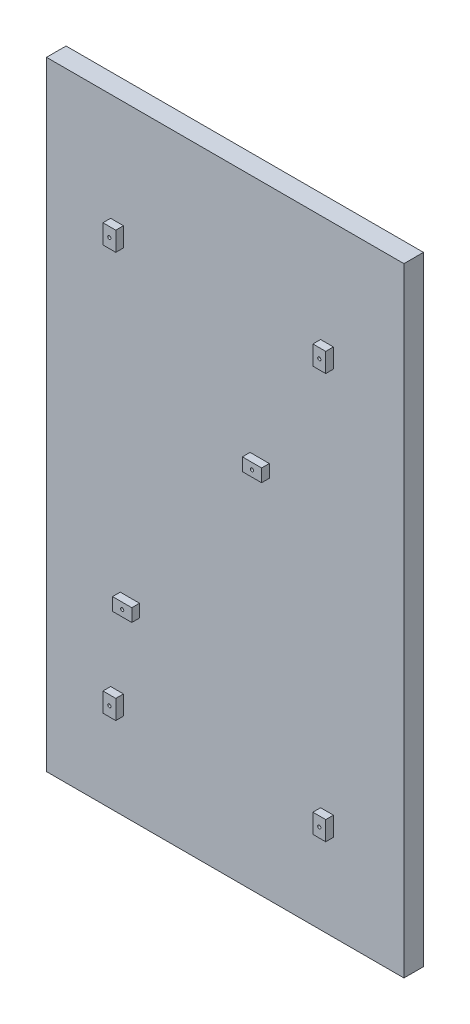
ISO-10303-21;
HEADER;
FILE_DESCRIPTION(('STEP AP214'),'2;1');
FILE_NAME('part.step','',(''),(''),'','','');
FILE_SCHEMA(('AUTOMOTIVE_DESIGN { 1 0 10303 214 1 1 1 1 }'));
ENDSEC;
DATA;
#1=APPLICATION_CONTEXT('core data for automotive mechanical design processes');
#2=APPLICATION_PROTOCOL_DEFINITION('international standard','automotive_design',2000,#1);
#3=PRODUCT_CONTEXT('',#1,'mechanical');
#4=PRODUCT('Part','Part','',(#3));
#5=PRODUCT_RELATED_PRODUCT_CATEGORY('part','',(#4));
#6=PRODUCT_DEFINITION_FORMATION('','',#4);
#7=PRODUCT_DEFINITION_CONTEXT('part definition',#1,'design');
#8=PRODUCT_DEFINITION('design','',#6,#7);
#9=PRODUCT_DEFINITION_SHAPE('','',#8);
#10=(LENGTH_UNIT() NAMED_UNIT(*) SI_UNIT(.MILLI.,.METRE.));
#11=(NAMED_UNIT(*) PLANE_ANGLE_UNIT() SI_UNIT($,.RADIAN.));
#12=(NAMED_UNIT(*) SI_UNIT($,.STERADIAN.) SOLID_ANGLE_UNIT());
#13=UNCERTAINTY_MEASURE_WITH_UNIT(LENGTH_MEASURE(1.E-05),#10,'distance_accuracy_value','');
#14=(GEOMETRIC_REPRESENTATION_CONTEXT(3) GLOBAL_UNCERTAINTY_ASSIGNED_CONTEXT((#13)) GLOBAL_UNIT_ASSIGNED_CONTEXT((#10,
#11,#12)) REPRESENTATION_CONTEXT('',''));
#15=CARTESIAN_POINT('',(0.,0.,0.));
#16=DIRECTION('',(0.,0.,1.));
#17=DIRECTION('',(1.,0.,0.));
#18=AXIS2_PLACEMENT_3D('',#15,#16,#17);
#19=CARTESIAN_POINT('',(111.5,0.,6.1));
#20=DIRECTION('',(0.,1.,0.));
#21=DIRECTION('',(0.,0.,1.));
#22=AXIS2_PLACEMENT_3D('',#19,#20,#21);
#23=PLANE('',#22);
#24=DIRECTION('',(1.,0.,0.));
#25=VECTOR('',#24,1.);
#26=CARTESIAN_POINT('',(111.5,0.,0.));
#27=LINE('',#26,#25);
#28=CARTESIAN_POINT('',(0.,0.,0.));
#29=VERTEX_POINT('',#28);
#30=CARTESIAN_POINT('',(111.5,0.,0.));
#31=VERTEX_POINT('',#30);
#32=EDGE_CURVE('E437',#29,#31,#27,.T.);
#33=ORIENTED_EDGE('',*,*,#32,.T.);
#34=DIRECTION('',(0.,0.,-1.));
#35=VECTOR('',#34,1.);
#36=CARTESIAN_POINT('',(111.5,0.,6.1));
#37=LINE('',#36,#35);
#38=CARTESIAN_POINT('',(111.5,0.,6.1));
#39=VERTEX_POINT('',#38);
#40=EDGE_CURVE('E11',#39,#31,#37,.T.);
#41=ORIENTED_EDGE('',*,*,#40,.F.);
#42=DIRECTION('',(1.,0.,0.));
#43=VECTOR('',#42,1.);
#44=CARTESIAN_POINT('',(111.5,0.,6.1));
#45=LINE('',#44,#43);
#46=CARTESIAN_POINT('',(0.,0.,6.1));
#47=VERTEX_POINT('',#46);
#48=EDGE_CURVE('E438',#47,#39,#45,.T.);
#49=ORIENTED_EDGE('',*,*,#48,.F.);
#50=DIRECTION('',(0.,0.,-1.));
#51=VECTOR('',#50,1.);
#52=CARTESIAN_POINT('',(0.,0.,6.1));
#53=LINE('',#52,#51);
#54=EDGE_CURVE('E448',#47,#29,#53,.T.);
#55=ORIENTED_EDGE('',*,*,#54,.T.);
#56=EDGE_LOOP('',(#33,#41,#49,#55));
#57=FACE_BOUND('',#56,.T.);
#58=ADVANCED_FACE('F32',(#57),#23,.F.);
#59=CARTESIAN_POINT('',(111.5,193.,6.1));
#60=DIRECTION('',(-1.,0.,0.));
#61=DIRECTION('',(0.,0.,1.));
#62=AXIS2_PLACEMENT_3D('',#59,#60,#61);
#63=PLANE('',#62);
#64=DIRECTION('',(0.,1.,0.));
#65=VECTOR('',#64,1.);
#66=CARTESIAN_POINT('',(111.5,193.,0.));
#67=LINE('',#66,#65);
#68=CARTESIAN_POINT('',(111.5,193.,0.));
#69=VERTEX_POINT('',#68);
#70=EDGE_CURVE('E451',#31,#69,#67,.T.);
#71=ORIENTED_EDGE('',*,*,#70,.T.);
#72=DIRECTION('',(0.,0.,-1.));
#73=VECTOR('',#72,1.);
#74=CARTESIAN_POINT('',(111.5,193.,6.1));
#75=LINE('',#74,#73);
#76=CARTESIAN_POINT('',(111.5,193.,6.1));
#77=VERTEX_POINT('',#76);
#78=EDGE_CURVE('E39',#77,#69,#75,.T.);
#79=ORIENTED_EDGE('',*,*,#78,.F.);
#80=DIRECTION('',(0.,1.,0.));
#81=VECTOR('',#80,1.);
#82=CARTESIAN_POINT('',(111.5,193.,6.1));
#83=LINE('',#82,#81);
#84=EDGE_CURVE('E441',#39,#77,#83,.T.);
#85=ORIENTED_EDGE('',*,*,#84,.F.);
#86=ORIENTED_EDGE('',*,*,#40,.T.);
#87=EDGE_LOOP('',(#71,#79,#85,#86));
#88=FACE_BOUND('',#87,.T.);
#89=ADVANCED_FACE('F481',(#88),#63,.F.);
#90=CARTESIAN_POINT('',(0.,193.,6.1));
#91=DIRECTION('',(0.,-1.,0.));
#92=DIRECTION('',(0.,0.,-1.));
#93=AXIS2_PLACEMENT_3D('',#90,#91,#92);
#94=PLANE('',#93);
#95=DIRECTION('',(-1.,0.,0.));
#96=VECTOR('',#95,1.);
#97=CARTESIAN_POINT('',(0.,193.,0.));
#98=LINE('',#97,#96);
#99=CARTESIAN_POINT('',(0.,193.,0.));
#100=VERTEX_POINT('',#99);
#101=EDGE_CURVE('E453',#69,#100,#98,.T.);
#102=ORIENTED_EDGE('',*,*,#101,.T.);
#103=DIRECTION('',(0.,0.,-1.));
#104=VECTOR('',#103,1.);
#105=CARTESIAN_POINT('',(0.,193.,6.1));
#106=LINE('',#105,#104);
#107=CARTESIAN_POINT('',(0.,193.,6.1));
#108=VERTEX_POINT('',#107);
#109=EDGE_CURVE('E458',#108,#100,#106,.T.);
#110=ORIENTED_EDGE('',*,*,#109,.F.);
#111=DIRECTION('',(-1.,0.,0.));
#112=VECTOR('',#111,1.);
#113=CARTESIAN_POINT('',(0.,193.,6.1));
#114=LINE('',#113,#112);
#115=EDGE_CURVE('E444',#77,#108,#114,.T.);
#116=ORIENTED_EDGE('',*,*,#115,.F.);
#117=ORIENTED_EDGE('',*,*,#78,.T.);
#118=EDGE_LOOP('',(#102,#110,#116,#117));
#119=FACE_BOUND('',#118,.T.);
#120=ADVANCED_FACE('F465',(#119),#94,.F.);
#121=CARTESIAN_POINT('',(0.,0.,6.1));
#122=DIRECTION('',(1.,0.,0.));
#123=DIRECTION('',(0.,0.,-1.));
#124=AXIS2_PLACEMENT_3D('',#121,#122,#123);
#125=PLANE('',#124);
#126=DIRECTION('',(0.,-1.,0.));
#127=VECTOR('',#126,1.);
#128=CARTESIAN_POINT('',(0.,0.,0.));
#129=LINE('',#128,#127);
#130=EDGE_CURVE('E442',#100,#29,#129,.T.);
#131=ORIENTED_EDGE('',*,*,#130,.T.);
#132=ORIENTED_EDGE('',*,*,#54,.F.);
#133=DIRECTION('',(0.,-1.,0.));
#134=VECTOR('',#133,1.);
#135=CARTESIAN_POINT('',(0.,0.,6.1));
#136=LINE('',#135,#134);
#137=EDGE_CURVE('E446',#108,#47,#136,.T.);
#138=ORIENTED_EDGE('',*,*,#137,.F.);
#139=ORIENTED_EDGE('',*,*,#109,.T.);
#140=EDGE_LOOP('',(#131,#132,#138,#139));
#141=FACE_BOUND('',#140,.T.);
#142=ADVANCED_FACE('F474',(#141),#125,.F.);
#143=CARTESIAN_POINT('',(0.,0.,6.1));
#144=DIRECTION('',(0.,0.,-1.));
#145=DIRECTION('',(-1.,0.,0.));
#146=AXIS2_PLACEMENT_3D('',#143,#144,#145);
#147=PLANE('',#146);
#148=DIRECTION('',(0.,-1.,0.));
#149=VECTOR('',#148,1.);
#150=CARTESIAN_POINT('',(23.,60.,6.1));
#151=LINE('',#150,#149);
#152=CARTESIAN_POINT('',(23.,60.,6.1));
#153=VERTEX_POINT('',#152);
#154=CARTESIAN_POINT('',(23.,56.,6.1));
#155=VERTEX_POINT('',#154);
#156=EDGE_CURVE('E237',#153,#155,#151,.T.);
#157=ORIENTED_EDGE('',*,*,#156,.F.);
#158=DIRECTION('',(-1.,0.,0.));
#159=VECTOR('',#158,1.);
#160=CARTESIAN_POINT('',(23.,60.,6.1));
#161=LINE('',#160,#159);
#162=CARTESIAN_POINT('',(29.,60.,6.1));
#163=VERTEX_POINT('',#162);
#164=EDGE_CURVE('E234',#163,#153,#161,.T.);
#165=ORIENTED_EDGE('',*,*,#164,.F.);
#166=DIRECTION('',(0.,1.,0.));
#167=VECTOR('',#166,1.);
#168=CARTESIAN_POINT('',(29.,60.,6.1));
#169=LINE('',#168,#167);
#170=CARTESIAN_POINT('',(29.,56.,6.1));
#171=VERTEX_POINT('',#170);
#172=EDGE_CURVE('E51',#171,#163,#169,.T.);
#173=ORIENTED_EDGE('',*,*,#172,.F.);
#174=DIRECTION('',(1.,0.,0.));
#175=VECTOR('',#174,1.);
#176=CARTESIAN_POINT('',(23.,56.,6.1));
#177=LINE('',#176,#175);
#178=EDGE_CURVE('E46',#155,#171,#177,.T.);
#179=ORIENTED_EDGE('',*,*,#178,.F.);
#180=EDGE_LOOP('',(#157,#165,#173,#179));
#181=FACE_BOUND('',#180,.T.);
#182=DIRECTION('',(0.,-1.,0.));
#183=VECTOR('',#182,1.);
#184=CARTESIAN_POINT('',(63.5,118.,6.1));
#185=LINE('',#184,#183);
#186=CARTESIAN_POINT('',(63.5,118.,6.1));
#187=VERTEX_POINT('',#186);
#188=CARTESIAN_POINT('',(63.5,114.,6.1));
#189=VERTEX_POINT('',#188);
#190=EDGE_CURVE('E248',#187,#189,#185,.T.);
#191=ORIENTED_EDGE('',*,*,#190,.F.);
#192=DIRECTION('',(-1.,0.,0.));
#193=VECTOR('',#192,1.);
#194=CARTESIAN_POINT('',(63.5,118.,6.1));
#195=LINE('',#194,#193);
#196=CARTESIAN_POINT('',(69.5,118.,6.1));
#197=VERTEX_POINT('',#196);
#198=EDGE_CURVE('E254',#197,#187,#195,.T.);
#199=ORIENTED_EDGE('',*,*,#198,.F.);
#200=DIRECTION('',(0.,1.,0.));
#201=VECTOR('',#200,1.);
#202=CARTESIAN_POINT('',(69.5,118.,6.1));
#203=LINE('',#202,#201);
#204=CARTESIAN_POINT('',(69.5,114.,6.1));
#205=VERTEX_POINT('',#204);
#206=EDGE_CURVE('E266',#205,#197,#203,.T.);
#207=ORIENTED_EDGE('',*,*,#206,.F.);
#208=DIRECTION('',(1.,0.,0.));
#209=VECTOR('',#208,1.);
#210=CARTESIAN_POINT('',(63.5,114.,6.1));
#211=LINE('',#210,#209);
#212=EDGE_CURVE('E263',#189,#205,#211,.T.);
#213=ORIENTED_EDGE('',*,*,#212,.F.);
#214=EDGE_LOOP('',(#191,#199,#207,#213));
#215=FACE_BOUND('',#214,.T.);
#216=DIRECTION('',(0.,-1.,0.));
#217=VECTOR('',#216,1.);
#218=CARTESIAN_POINT('',(85.5,159.5,6.1));
#219=LINE('',#218,#217);
#220=CARTESIAN_POINT('',(85.5,159.5,6.1));
#221=VERTEX_POINT('',#220);
#222=CARTESIAN_POINT('',(85.5,153.5,6.1));
#223=VERTEX_POINT('',#222);
#224=EDGE_CURVE('E286',#221,#223,#219,.T.);
#225=ORIENTED_EDGE('',*,*,#224,.F.);
#226=DIRECTION('',(-1.,0.,0.));
#227=VECTOR('',#226,1.);
#228=CARTESIAN_POINT('',(85.5,159.5,6.1));
#229=LINE('',#228,#227);
#230=CARTESIAN_POINT('',(89.5,159.5,6.1));
#231=VERTEX_POINT('',#230);
#232=EDGE_CURVE('E293',#231,#221,#229,.T.);
#233=ORIENTED_EDGE('',*,*,#232,.F.);
#234=DIRECTION('',(0.,1.,0.));
#235=VECTOR('',#234,1.);
#236=CARTESIAN_POINT('',(89.5,159.5,6.1));
#237=LINE('',#236,#235);
#238=CARTESIAN_POINT('',(89.5,153.5,6.1));
#239=VERTEX_POINT('',#238);
#240=EDGE_CURVE('E305',#239,#231,#237,.T.);
#241=ORIENTED_EDGE('',*,*,#240,.F.);
#242=DIRECTION('',(1.,0.,0.));
#243=VECTOR('',#242,1.);
#244=CARTESIAN_POINT('',(85.5,153.5,6.1));
#245=LINE('',#244,#243);
#246=EDGE_CURVE('E302',#223,#239,#245,.T.);
#247=ORIENTED_EDGE('',*,*,#246,.F.);
#248=EDGE_LOOP('',(#225,#233,#241,#247));
#249=FACE_BOUND('',#248,.T.);
#250=DIRECTION('',(0.,-1.,0.));
#251=VECTOR('',#250,1.);
#252=CARTESIAN_POINT('',(20.,159.5,6.1));
#253=LINE('',#252,#251);
#254=CARTESIAN_POINT('',(20.,159.5,6.1));
#255=VERTEX_POINT('',#254);
#256=CARTESIAN_POINT('',(20.,153.5,6.1));
#257=VERTEX_POINT('',#256);
#258=EDGE_CURVE('E325',#255,#257,#253,.T.);
#259=ORIENTED_EDGE('',*,*,#258,.F.);
#260=DIRECTION('',(-1.,0.,0.));
#261=VECTOR('',#260,1.);
#262=CARTESIAN_POINT('',(20.,159.5,6.1));
#263=LINE('',#262,#261);
#264=CARTESIAN_POINT('',(24.,159.5,6.1));
#265=VERTEX_POINT('',#264);
#266=EDGE_CURVE('E332',#265,#255,#263,.T.);
#267=ORIENTED_EDGE('',*,*,#266,.F.);
#268=DIRECTION('',(0.,1.,0.));
#269=VECTOR('',#268,1.);
#270=CARTESIAN_POINT('',(24.,159.5,6.1));
#271=LINE('',#270,#269);
#272=CARTESIAN_POINT('',(24.,153.5,6.1));
#273=VERTEX_POINT('',#272);
#274=EDGE_CURVE('E344',#273,#265,#271,.T.);
#275=ORIENTED_EDGE('',*,*,#274,.F.);
#276=DIRECTION('',(1.,0.,0.));
#277=VECTOR('',#276,1.);
#278=CARTESIAN_POINT('',(20.,153.5,6.1));
#279=LINE('',#278,#277);
#280=EDGE_CURVE('E341',#257,#273,#279,.T.);
#281=ORIENTED_EDGE('',*,*,#280,.F.);
#282=EDGE_LOOP('',(#259,#267,#275,#281));
#283=FACE_BOUND('',#282,.T.);
#284=DIRECTION('',(0.,-1.,0.));
#285=VECTOR('',#284,1.);
#286=CARTESIAN_POINT('',(20.,33.,6.1));
#287=LINE('',#286,#285);
#288=CARTESIAN_POINT('',(20.,33.,6.1));
#289=VERTEX_POINT('',#288);
#290=CARTESIAN_POINT('',(20.,27.,6.1));
#291=VERTEX_POINT('',#290);
#292=EDGE_CURVE('E364',#289,#291,#287,.T.);
#293=ORIENTED_EDGE('',*,*,#292,.F.);
#294=DIRECTION('',(-1.,0.,0.));
#295=VECTOR('',#294,1.);
#296=CARTESIAN_POINT('',(20.,33.,6.1));
#297=LINE('',#296,#295);
#298=CARTESIAN_POINT('',(24.,33.,6.1));
#299=VERTEX_POINT('',#298);
#300=EDGE_CURVE('E371',#299,#289,#297,.T.);
#301=ORIENTED_EDGE('',*,*,#300,.F.);
#302=DIRECTION('',(0.,1.,0.));
#303=VECTOR('',#302,1.);
#304=CARTESIAN_POINT('',(24.,33.,6.1));
#305=LINE('',#304,#303);
#306=CARTESIAN_POINT('',(24.,27.,6.1));
#307=VERTEX_POINT('',#306);
#308=EDGE_CURVE('E383',#307,#299,#305,.T.);
#309=ORIENTED_EDGE('',*,*,#308,.F.);
#310=DIRECTION('',(1.,0.,0.));
#311=VECTOR('',#310,1.);
#312=CARTESIAN_POINT('',(20.,27.,6.1));
#313=LINE('',#312,#311);
#314=EDGE_CURVE('E380',#291,#307,#313,.T.);
#315=ORIENTED_EDGE('',*,*,#314,.F.);
#316=EDGE_LOOP('',(#293,#301,#309,#315));
#317=FACE_BOUND('',#316,.T.);
#318=DIRECTION('',(-1.,0.,0.));
#319=VECTOR('',#318,1.);
#320=CARTESIAN_POINT('',(87.5,33.,6.1));
#321=LINE('',#320,#319);
#322=CARTESIAN_POINT('',(89.5,33.,6.1));
#323=VERTEX_POINT('',#322);
#324=CARTESIAN_POINT('',(85.5,33.,6.1));
#325=VERTEX_POINT('',#324);
#326=EDGE_CURVE('E403',#323,#325,#321,.T.);
#327=ORIENTED_EDGE('',*,*,#326,.F.);
#328=DIRECTION('',(0.,1.,0.));
#329=VECTOR('',#328,1.);
#330=CARTESIAN_POINT('',(89.5,27.,6.1));
#331=LINE('',#330,#329);
#332=CARTESIAN_POINT('',(89.5,27.,6.1));
#333=VERTEX_POINT('',#332);
#334=EDGE_CURVE('E409',#333,#323,#331,.T.);
#335=ORIENTED_EDGE('',*,*,#334,.F.);
#336=DIRECTION('',(1.,0.,0.));
#337=VECTOR('',#336,1.);
#338=CARTESIAN_POINT('',(85.5,27.,6.1));
#339=LINE('',#338,#337);
#340=CARTESIAN_POINT('',(85.5,27.,6.1));
#341=VERTEX_POINT('',#340);
#342=EDGE_CURVE('E421',#341,#333,#339,.T.);
#343=ORIENTED_EDGE('',*,*,#342,.F.);
#344=DIRECTION('',(0.,-1.,0.));
#345=VECTOR('',#344,1.);
#346=CARTESIAN_POINT('',(85.5,33.,6.1));
#347=LINE('',#346,#345);
#348=EDGE_CURVE('E418',#325,#341,#347,.T.);
#349=ORIENTED_EDGE('',*,*,#348,.F.);
#350=EDGE_LOOP('',(#327,#335,#343,#349));
#351=FACE_BOUND('',#350,.T.);
#352=ORIENTED_EDGE('',*,*,#48,.T.);
#353=ORIENTED_EDGE('',*,*,#84,.T.);
#354=ORIENTED_EDGE('',*,*,#115,.T.);
#355=ORIENTED_EDGE('',*,*,#137,.T.);
#356=EDGE_LOOP('',(#352,#353,#354,#355));
#357=FACE_BOUND('',#356,.T.);
#358=ADVANCED_FACE('F480',(#181,#215,#249,#283,#317,#351,#357),#147,.F.);
#359=CARTESIAN_POINT('',(0.,0.,0.));
#360=DIRECTION('',(0.,0.,-1.));
#361=DIRECTION('',(-1.,0.,0.));
#362=AXIS2_PLACEMENT_3D('',#359,#360,#361);
#363=PLANE('',#362);
#364=ORIENTED_EDGE('',*,*,#32,.F.);
#365=ORIENTED_EDGE('',*,*,#130,.F.);
#366=ORIENTED_EDGE('',*,*,#101,.F.);
#367=ORIENTED_EDGE('',*,*,#70,.F.);
#368=EDGE_LOOP('',(#364,#365,#366,#367));
#369=FACE_BOUND('',#368,.T.);
#370=ADVANCED_FACE('F471',(#369),#363,.T.);
#371=CARTESIAN_POINT('',(0.,0.,8.5));
#372=DIRECTION('',(0.,0.,1.));
#373=DIRECTION('',(1.,0.,0.));
#374=AXIS2_PLACEMENT_3D('',#371,#372,#373);
#375=PLANE('',#374);
#376=DIRECTION('',(-1.,0.,0.));
#377=VECTOR('',#376,1.);
#378=CARTESIAN_POINT('',(89.5,33.,8.5));
#379=LINE('',#378,#377);
#380=CARTESIAN_POINT('',(89.5,33.,8.5));
#381=VERTEX_POINT('',#380);
#382=CARTESIAN_POINT('',(85.5,33.,8.5));
#383=VERTEX_POINT('',#382);
#384=EDGE_CURVE('E406',#381,#383,#379,.T.);
#385=ORIENTED_EDGE('',*,*,#384,.T.);
#386=DIRECTION('',(0.,-1.,0.));
#387=VECTOR('',#386,1.);
#388=CARTESIAN_POINT('',(85.5,33.,8.5));
#389=LINE('',#388,#387);
#390=CARTESIAN_POINT('',(85.5,27.,8.5));
#391=VERTEX_POINT('',#390);
#392=EDGE_CURVE('E408',#383,#391,#389,.T.);
#393=ORIENTED_EDGE('',*,*,#392,.T.);
#394=DIRECTION('',(1.,0.,0.));
#395=VECTOR('',#394,1.);
#396=CARTESIAN_POINT('',(85.5,27.,8.5));
#397=LINE('',#396,#395);
#398=CARTESIAN_POINT('',(89.5,27.,8.5));
#399=VERTEX_POINT('',#398);
#400=EDGE_CURVE('E411',#391,#399,#397,.T.);
#401=ORIENTED_EDGE('',*,*,#400,.T.);
#402=DIRECTION('',(0.,1.,0.));
#403=VECTOR('',#402,1.);
#404=CARTESIAN_POINT('',(89.5,27.,8.5));
#405=LINE('',#404,#403);
#406=EDGE_CURVE('E413',#399,#381,#405,.T.);
#407=ORIENTED_EDGE('',*,*,#406,.T.);
#408=EDGE_LOOP('',(#385,#393,#401,#407));
#409=FACE_BOUND('',#408,.T.);
#410=CARTESIAN_POINT('',(87.5,30.,8.5));
#411=DIRECTION('',(0.,0.,1.));
#412=DIRECTION('',(1.,0.,0.));
#413=AXIS2_PLACEMENT_3D('',#410,#411,#412);
#414=CIRCLE('',#413,0.499999999999999);
#415=CARTESIAN_POINT('',(88.,30.,8.5));
#416=VERTEX_POINT('',#415);
#417=EDGE_CURVE('E400',#416,#416,#414,.T.);
#418=ORIENTED_EDGE('',*,*,#417,.F.);
#419=EDGE_LOOP('',(#418));
#420=FACE_BOUND('',#419,.T.);
#421=ADVANCED_FACE('F493',(#409,#420),#375,.T.);
#422=CARTESIAN_POINT('',(87.5,33.,8.5));
#423=DIRECTION('',(0.,-1.,0.));
#424=DIRECTION('',(0.,0.,-1.));
#425=AXIS2_PLACEMENT_3D('',#422,#423,#424);
#426=PLANE('',#425);
#427=ORIENTED_EDGE('',*,*,#326,.T.);
#428=DIRECTION('',(0.,0.,-1.));
#429=VECTOR('',#428,1.);
#430=CARTESIAN_POINT('',(85.5,33.,8.5));
#431=LINE('',#430,#429);
#432=EDGE_CURVE('E434',#383,#325,#431,.T.);
#433=ORIENTED_EDGE('',*,*,#432,.F.);
#434=ORIENTED_EDGE('',*,*,#384,.F.);
#435=DIRECTION('',(0.,0.,-1.));
#436=VECTOR('',#435,1.);
#437=CARTESIAN_POINT('',(89.5,33.,8.5));
#438=LINE('',#437,#436);
#439=EDGE_CURVE('E415',#381,#323,#438,.T.);
#440=ORIENTED_EDGE('',*,*,#439,.T.);
#441=EDGE_LOOP('',(#427,#433,#434,#440));
#442=FACE_BOUND('',#441,.T.);
#443=ADVANCED_FACE('F498',(#442),#426,.F.);
#444=CARTESIAN_POINT('',(85.5,33.,8.5));
#445=DIRECTION('',(1.,0.,0.));
#446=DIRECTION('',(0.,0.,-1.));
#447=AXIS2_PLACEMENT_3D('',#444,#445,#446);
#448=PLANE('',#447);
#449=ORIENTED_EDGE('',*,*,#348,.T.);
#450=DIRECTION('',(0.,0.,-1.));
#451=VECTOR('',#450,1.);
#452=CARTESIAN_POINT('',(85.5,27.,8.5));
#453=LINE('',#452,#451);
#454=EDGE_CURVE('E431',#391,#341,#453,.T.);
#455=ORIENTED_EDGE('',*,*,#454,.F.);
#456=ORIENTED_EDGE('',*,*,#392,.F.);
#457=ORIENTED_EDGE('',*,*,#432,.T.);
#458=EDGE_LOOP('',(#449,#455,#456,#457));
#459=FACE_BOUND('',#458,.T.);
#460=ADVANCED_FACE('F501',(#459),#448,.F.);
#461=CARTESIAN_POINT('',(85.5,27.,8.5));
#462=DIRECTION('',(0.,1.,0.));
#463=DIRECTION('',(0.,0.,1.));
#464=AXIS2_PLACEMENT_3D('',#461,#462,#463);
#465=PLANE('',#464);
#466=ORIENTED_EDGE('',*,*,#342,.T.);
#467=DIRECTION('',(0.,0.,-1.));
#468=VECTOR('',#467,1.);
#469=CARTESIAN_POINT('',(89.5,27.,8.5));
#470=LINE('',#469,#468);
#471=EDGE_CURVE('E428',#399,#333,#470,.T.);
#472=ORIENTED_EDGE('',*,*,#471,.F.);
#473=ORIENTED_EDGE('',*,*,#400,.F.);
#474=ORIENTED_EDGE('',*,*,#454,.T.);
#475=EDGE_LOOP('',(#466,#472,#473,#474));
#476=FACE_BOUND('',#475,.T.);
#477=ADVANCED_FACE('F505',(#476),#465,.F.);
#478=CARTESIAN_POINT('',(89.5,27.,8.5));
#479=DIRECTION('',(-1.,0.,0.));
#480=DIRECTION('',(0.,0.,1.));
#481=AXIS2_PLACEMENT_3D('',#478,#479,#480);
#482=PLANE('',#481);
#483=ORIENTED_EDGE('',*,*,#334,.T.);
#484=ORIENTED_EDGE('',*,*,#439,.F.);
#485=ORIENTED_EDGE('',*,*,#406,.F.);
#486=ORIENTED_EDGE('',*,*,#471,.T.);
#487=EDGE_LOOP('',(#483,#484,#485,#486));
#488=FACE_BOUND('',#487,.T.);
#489=ADVANCED_FACE('F509',(#488),#482,.F.);
#490=CARTESIAN_POINT('',(87.5,30.,8.5));
#491=DIRECTION('',(0.,0.,-1.));
#492=DIRECTION('',(-1.,0.,0.));
#493=AXIS2_PLACEMENT_3D('',#490,#491,#492);
#494=CYLINDRICAL_SURFACE('',#493,0.499999999999999);
#495=ORIENTED_EDGE('',*,*,#417,.T.);
#496=EDGE_LOOP('',(#495));
#497=FACE_BOUND('',#496,.T.);
#498=CARTESIAN_POINT('',(87.5,30.,6.1));
#499=DIRECTION('',(0.,0.,1.));
#500=DIRECTION('',(1.,0.,0.));
#501=AXIS2_PLACEMENT_3D('',#498,#499,#500);
#502=CIRCLE('',#501,0.499999999999999);
#503=CARTESIAN_POINT('',(88.,30.,6.1));
#504=VERTEX_POINT('',#503);
#505=EDGE_CURVE('E399',#504,#504,#502,.T.);
#506=ORIENTED_EDGE('',*,*,#505,.F.);
#507=EDGE_LOOP('',(#506));
#508=FACE_BOUND('',#507,.T.);
#509=ADVANCED_FACE('F513',(#497,#508),#494,.F.);
#510=ORIENTED_EDGE('',*,*,#505,.T.);
#511=EDGE_LOOP('',(#510));
#512=FACE_BOUND('',#511,.T.);
#513=ADVANCED_FACE('F497',(#512),#147,.F.);
#514=CARTESIAN_POINT('',(0.,0.,8.5));
#515=DIRECTION('',(0.,0.,1.));
#516=DIRECTION('',(1.,0.,0.));
#517=AXIS2_PLACEMENT_3D('',#514,#515,#516);
#518=PLANE('',#517);
#519=DIRECTION('',(0.,-1.,0.));
#520=VECTOR('',#519,1.);
#521=CARTESIAN_POINT('',(20.,33.,8.5));
#522=LINE('',#521,#520);
#523=CARTESIAN_POINT('',(20.,33.,8.5));
#524=VERTEX_POINT('',#523);
#525=CARTESIAN_POINT('',(20.,27.,8.5));
#526=VERTEX_POINT('',#525);
#527=EDGE_CURVE('E367',#524,#526,#522,.T.);
#528=ORIENTED_EDGE('',*,*,#527,.T.);
#529=DIRECTION('',(1.,0.,0.));
#530=VECTOR('',#529,1.);
#531=CARTESIAN_POINT('',(20.,27.,8.5));
#532=LINE('',#531,#530);
#533=CARTESIAN_POINT('',(24.,27.,8.5));
#534=VERTEX_POINT('',#533);
#535=EDGE_CURVE('E370',#526,#534,#532,.T.);
#536=ORIENTED_EDGE('',*,*,#535,.T.);
#537=DIRECTION('',(0.,1.,0.));
#538=VECTOR('',#537,1.);
#539=CARTESIAN_POINT('',(24.,33.,8.5));
#540=LINE('',#539,#538);
#541=CARTESIAN_POINT('',(24.,33.,8.5));
#542=VERTEX_POINT('',#541);
#543=EDGE_CURVE('E373',#534,#542,#540,.T.);
#544=ORIENTED_EDGE('',*,*,#543,.T.);
#545=DIRECTION('',(-1.,0.,0.));
#546=VECTOR('',#545,1.);
#547=CARTESIAN_POINT('',(20.,33.,8.5));
#548=LINE('',#547,#546);
#549=EDGE_CURVE('E375',#542,#524,#548,.T.);
#550=ORIENTED_EDGE('',*,*,#549,.T.);
#551=EDGE_LOOP('',(#528,#536,#544,#550));
#552=FACE_BOUND('',#551,.T.);
#553=CARTESIAN_POINT('',(22.,30.,8.5));
#554=DIRECTION('',(0.,0.,1.));
#555=DIRECTION('',(1.,0.,0.));
#556=AXIS2_PLACEMENT_3D('',#553,#554,#555);
#557=CIRCLE('',#556,0.499999999999999);
#558=CARTESIAN_POINT('',(22.5,30.,8.5));
#559=VERTEX_POINT('',#558);
#560=EDGE_CURVE('E361',#559,#559,#557,.T.);
#561=ORIENTED_EDGE('',*,*,#560,.F.);
#562=EDGE_LOOP('',(#561));
#563=FACE_BOUND('',#562,.T.);
#564=ADVANCED_FACE('F525',(#552,#563),#518,.T.);
#565=CARTESIAN_POINT('',(20.,33.,8.5));
#566=DIRECTION('',(1.,0.,0.));
#567=DIRECTION('',(0.,0.,-1.));
#568=AXIS2_PLACEMENT_3D('',#565,#566,#567);
#569=PLANE('',#568);
#570=ORIENTED_EDGE('',*,*,#292,.T.);
#571=DIRECTION('',(0.,0.,-1.));
#572=VECTOR('',#571,1.);
#573=CARTESIAN_POINT('',(20.,27.,8.5));
#574=LINE('',#573,#572);
#575=EDGE_CURVE('E396',#526,#291,#574,.T.);
#576=ORIENTED_EDGE('',*,*,#575,.F.);
#577=ORIENTED_EDGE('',*,*,#527,.F.);
#578=DIRECTION('',(0.,0.,-1.));
#579=VECTOR('',#578,1.);
#580=CARTESIAN_POINT('',(20.,33.,8.5));
#581=LINE('',#580,#579);
#582=EDGE_CURVE('E377',#524,#289,#581,.T.);
#583=ORIENTED_EDGE('',*,*,#582,.T.);
#584=EDGE_LOOP('',(#570,#576,#577,#583));
#585=FACE_BOUND('',#584,.T.);
#586=ADVANCED_FACE('F521',(#585),#569,.F.);
#587=CARTESIAN_POINT('',(20.,27.,8.5));
#588=DIRECTION('',(0.,1.,0.));
#589=DIRECTION('',(0.,0.,1.));
#590=AXIS2_PLACEMENT_3D('',#587,#588,#589);
#591=PLANE('',#590);
#592=ORIENTED_EDGE('',*,*,#314,.T.);
#593=DIRECTION('',(0.,0.,-1.));
#594=VECTOR('',#593,1.);
#595=CARTESIAN_POINT('',(24.,27.,8.5));
#596=LINE('',#595,#594);
#597=EDGE_CURVE('E393',#534,#307,#596,.T.);
#598=ORIENTED_EDGE('',*,*,#597,.F.);
#599=ORIENTED_EDGE('',*,*,#535,.F.);
#600=ORIENTED_EDGE('',*,*,#575,.T.);
#601=EDGE_LOOP('',(#592,#598,#599,#600));
#602=FACE_BOUND('',#601,.T.);
#603=ADVANCED_FACE('F524',(#602),#591,.F.);
#604=CARTESIAN_POINT('',(24.,33.,8.5));
#605=DIRECTION('',(-1.,0.,0.));
#606=DIRECTION('',(0.,0.,1.));
#607=AXIS2_PLACEMENT_3D('',#604,#605,#606);
#608=PLANE('',#607);
#609=ORIENTED_EDGE('',*,*,#308,.T.);
#610=DIRECTION('',(0.,0.,-1.));
#611=VECTOR('',#610,1.);
#612=CARTESIAN_POINT('',(24.,33.,8.5));
#613=LINE('',#612,#611);
#614=EDGE_CURVE('E390',#542,#299,#613,.T.);
#615=ORIENTED_EDGE('',*,*,#614,.F.);
#616=ORIENTED_EDGE('',*,*,#543,.F.);
#617=ORIENTED_EDGE('',*,*,#597,.T.);
#618=EDGE_LOOP('',(#609,#615,#616,#617));
#619=FACE_BOUND('',#618,.T.);
#620=ADVANCED_FACE('F529',(#619),#608,.F.);
#621=CARTESIAN_POINT('',(20.,33.,8.5));
#622=DIRECTION('',(0.,-1.,0.));
#623=DIRECTION('',(0.,0.,-1.));
#624=AXIS2_PLACEMENT_3D('',#621,#622,#623);
#625=PLANE('',#624);
#626=ORIENTED_EDGE('',*,*,#300,.T.);
#627=ORIENTED_EDGE('',*,*,#582,.F.);
#628=ORIENTED_EDGE('',*,*,#549,.F.);
#629=ORIENTED_EDGE('',*,*,#614,.T.);
#630=EDGE_LOOP('',(#626,#627,#628,#629));
#631=FACE_BOUND('',#630,.T.);
#632=ADVANCED_FACE('F533',(#631),#625,.F.);
#633=CARTESIAN_POINT('',(22.,30.,8.5));
#634=DIRECTION('',(0.,0.,-1.));
#635=DIRECTION('',(-1.,0.,0.));
#636=AXIS2_PLACEMENT_3D('',#633,#634,#635);
#637=CYLINDRICAL_SURFACE('',#636,0.499999999999999);
#638=ORIENTED_EDGE('',*,*,#560,.T.);
#639=EDGE_LOOP('',(#638));
#640=FACE_BOUND('',#639,.T.);
#641=CARTESIAN_POINT('',(22.,30.,6.1));
#642=DIRECTION('',(0.,0.,1.));
#643=DIRECTION('',(1.,0.,0.));
#644=AXIS2_PLACEMENT_3D('',#641,#642,#643);
#645=CIRCLE('',#644,0.499999999999999);
#646=CARTESIAN_POINT('',(22.5,30.,6.1));
#647=VERTEX_POINT('',#646);
#648=EDGE_CURVE('E360',#647,#647,#645,.T.);
#649=ORIENTED_EDGE('',*,*,#648,.F.);
#650=EDGE_LOOP('',(#649));
#651=FACE_BOUND('',#650,.T.);
#652=ADVANCED_FACE('F537',(#640,#651),#637,.F.);
#653=ORIENTED_EDGE('',*,*,#648,.T.);
#654=EDGE_LOOP('',(#653));
#655=FACE_BOUND('',#654,.T.);
#656=ADVANCED_FACE('F544',(#655),#147,.F.);
#657=CARTESIAN_POINT('',(0.,0.,8.5));
#658=DIRECTION('',(0.,0.,1.));
#659=DIRECTION('',(1.,0.,0.));
#660=AXIS2_PLACEMENT_3D('',#657,#658,#659);
#661=PLANE('',#660);
#662=DIRECTION('',(0.,-1.,0.));
#663=VECTOR('',#662,1.);
#664=CARTESIAN_POINT('',(20.,159.5,8.5));
#665=LINE('',#664,#663);
#666=CARTESIAN_POINT('',(20.,159.5,8.5));
#667=VERTEX_POINT('',#666);
#668=CARTESIAN_POINT('',(20.,153.5,8.5));
#669=VERTEX_POINT('',#668);
#670=EDGE_CURVE('E328',#667,#669,#665,.T.);
#671=ORIENTED_EDGE('',*,*,#670,.T.);
#672=DIRECTION('',(1.,0.,0.));
#673=VECTOR('',#672,1.);
#674=CARTESIAN_POINT('',(20.,153.5,8.5));
#675=LINE('',#674,#673);
#676=CARTESIAN_POINT('',(24.,153.5,8.5));
#677=VERTEX_POINT('',#676);
#678=EDGE_CURVE('E331',#669,#677,#675,.T.);
#679=ORIENTED_EDGE('',*,*,#678,.T.);
#680=DIRECTION('',(0.,1.,0.));
#681=VECTOR('',#680,1.);
#682=CARTESIAN_POINT('',(24.,159.5,8.5));
#683=LINE('',#682,#681);
#684=CARTESIAN_POINT('',(24.,159.5,8.5));
#685=VERTEX_POINT('',#684);
#686=EDGE_CURVE('E334',#677,#685,#683,.T.);
#687=ORIENTED_EDGE('',*,*,#686,.T.);
#688=DIRECTION('',(-1.,0.,0.));
#689=VECTOR('',#688,1.);
#690=CARTESIAN_POINT('',(20.,159.5,8.5));
#691=LINE('',#690,#689);
#692=EDGE_CURVE('E336',#685,#667,#691,.T.);
#693=ORIENTED_EDGE('',*,*,#692,.T.);
#694=EDGE_LOOP('',(#671,#679,#687,#693));
#695=FACE_BOUND('',#694,.T.);
#696=CARTESIAN_POINT('',(22.,156.5,8.5));
#697=DIRECTION('',(0.,0.,1.));
#698=DIRECTION('',(1.,0.,0.));
#699=AXIS2_PLACEMENT_3D('',#696,#697,#698);
#700=CIRCLE('',#699,0.499999999999999);
#701=CARTESIAN_POINT('',(22.5,156.5,8.5));
#702=VERTEX_POINT('',#701);
#703=EDGE_CURVE('E322',#702,#702,#700,.T.);
#704=ORIENTED_EDGE('',*,*,#703,.F.);
#705=EDGE_LOOP('',(#704));
#706=FACE_BOUND('',#705,.T.);
#707=ADVANCED_FACE('F550',(#695,#706),#661,.T.);
#708=CARTESIAN_POINT('',(20.,159.5,8.5));
#709=DIRECTION('',(1.,0.,0.));
#710=DIRECTION('',(0.,0.,-1.));
#711=AXIS2_PLACEMENT_3D('',#708,#709,#710);
#712=PLANE('',#711);
#713=ORIENTED_EDGE('',*,*,#258,.T.);
#714=DIRECTION('',(0.,0.,-1.));
#715=VECTOR('',#714,1.);
#716=CARTESIAN_POINT('',(20.,153.5,8.5));
#717=LINE('',#716,#715);
#718=EDGE_CURVE('E357',#669,#257,#717,.T.);
#719=ORIENTED_EDGE('',*,*,#718,.F.);
#720=ORIENTED_EDGE('',*,*,#670,.F.);
#721=DIRECTION('',(0.,0.,-1.));
#722=VECTOR('',#721,1.);
#723=CARTESIAN_POINT('',(20.,159.5,8.5));
#724=LINE('',#723,#722);
#725=EDGE_CURVE('E338',#667,#255,#724,.T.);
#726=ORIENTED_EDGE('',*,*,#725,.T.);
#727=EDGE_LOOP('',(#713,#719,#720,#726));
#728=FACE_BOUND('',#727,.T.);
#729=ADVANCED_FACE('F546',(#728),#712,.F.);
#730=CARTESIAN_POINT('',(20.,153.5,8.5));
#731=DIRECTION('',(0.,1.,0.));
#732=DIRECTION('',(0.,0.,1.));
#733=AXIS2_PLACEMENT_3D('',#730,#731,#732);
#734=PLANE('',#733);
#735=ORIENTED_EDGE('',*,*,#280,.T.);
#736=DIRECTION('',(0.,0.,-1.));
#737=VECTOR('',#736,1.);
#738=CARTESIAN_POINT('',(24.,153.5,8.5));
#739=LINE('',#738,#737);
#740=EDGE_CURVE('E354',#677,#273,#739,.T.);
#741=ORIENTED_EDGE('',*,*,#740,.F.);
#742=ORIENTED_EDGE('',*,*,#678,.F.);
#743=ORIENTED_EDGE('',*,*,#718,.T.);
#744=EDGE_LOOP('',(#735,#741,#742,#743));
#745=FACE_BOUND('',#744,.T.);
#746=ADVANCED_FACE('F549',(#745),#734,.F.);
#747=CARTESIAN_POINT('',(24.,159.5,8.5));
#748=DIRECTION('',(-1.,0.,0.));
#749=DIRECTION('',(0.,0.,1.));
#750=AXIS2_PLACEMENT_3D('',#747,#748,#749);
#751=PLANE('',#750);
#752=ORIENTED_EDGE('',*,*,#274,.T.);
#753=DIRECTION('',(0.,0.,-1.));
#754=VECTOR('',#753,1.);
#755=CARTESIAN_POINT('',(24.,159.5,8.5));
#756=LINE('',#755,#754);
#757=EDGE_CURVE('E351',#685,#265,#756,.T.);
#758=ORIENTED_EDGE('',*,*,#757,.F.);
#759=ORIENTED_EDGE('',*,*,#686,.F.);
#760=ORIENTED_EDGE('',*,*,#740,.T.);
#761=EDGE_LOOP('',(#752,#758,#759,#760));
#762=FACE_BOUND('',#761,.T.);
#763=ADVANCED_FACE('F554',(#762),#751,.F.);
#764=CARTESIAN_POINT('',(20.,159.5,8.5));
#765=DIRECTION('',(0.,-1.,0.));
#766=DIRECTION('',(0.,0.,-1.));
#767=AXIS2_PLACEMENT_3D('',#764,#765,#766);
#768=PLANE('',#767);
#769=ORIENTED_EDGE('',*,*,#266,.T.);
#770=ORIENTED_EDGE('',*,*,#725,.F.);
#771=ORIENTED_EDGE('',*,*,#692,.F.);
#772=ORIENTED_EDGE('',*,*,#757,.T.);
#773=EDGE_LOOP('',(#769,#770,#771,#772));
#774=FACE_BOUND('',#773,.T.);
#775=ADVANCED_FACE('F558',(#774),#768,.F.);
#776=CARTESIAN_POINT('',(22.,156.5,8.5));
#777=DIRECTION('',(0.,0.,-1.));
#778=DIRECTION('',(-1.,0.,0.));
#779=AXIS2_PLACEMENT_3D('',#776,#777,#778);
#780=CYLINDRICAL_SURFACE('',#779,0.499999999999999);
#781=ORIENTED_EDGE('',*,*,#703,.T.);
#782=EDGE_LOOP('',(#781));
#783=FACE_BOUND('',#782,.T.);
#784=CARTESIAN_POINT('',(22.,156.5,6.1));
#785=DIRECTION('',(0.,0.,1.));
#786=DIRECTION('',(1.,0.,0.));
#787=AXIS2_PLACEMENT_3D('',#784,#785,#786);
#788=CIRCLE('',#787,0.499999999999999);
#789=CARTESIAN_POINT('',(22.5,156.5,6.1));
#790=VERTEX_POINT('',#789);
#791=EDGE_CURVE('E321',#790,#790,#788,.T.);
#792=ORIENTED_EDGE('',*,*,#791,.F.);
#793=EDGE_LOOP('',(#792));
#794=FACE_BOUND('',#793,.T.);
#795=ADVANCED_FACE('F562',(#783,#794),#780,.F.);
#796=ORIENTED_EDGE('',*,*,#791,.T.);
#797=EDGE_LOOP('',(#796));
#798=FACE_BOUND('',#797,.T.);
#799=ADVANCED_FACE('F569',(#798),#147,.F.);
#800=CARTESIAN_POINT('',(0.,0.,8.5));
#801=DIRECTION('',(0.,0.,1.));
#802=DIRECTION('',(1.,0.,0.));
#803=AXIS2_PLACEMENT_3D('',#800,#801,#802);
#804=PLANE('',#803);
#805=DIRECTION('',(0.,-1.,0.));
#806=VECTOR('',#805,1.);
#807=CARTESIAN_POINT('',(85.5,159.5,8.5));
#808=LINE('',#807,#806);
#809=CARTESIAN_POINT('',(85.5,159.5,8.5));
#810=VERTEX_POINT('',#809);
#811=CARTESIAN_POINT('',(85.5,153.5,8.5));
#812=VERTEX_POINT('',#811);
#813=EDGE_CURVE('E289',#810,#812,#808,.T.);
#814=ORIENTED_EDGE('',*,*,#813,.T.);
#815=DIRECTION('',(1.,0.,0.));
#816=VECTOR('',#815,1.);
#817=CARTESIAN_POINT('',(85.5,153.5,8.5));
#818=LINE('',#817,#816);
#819=CARTESIAN_POINT('',(89.5,153.5,8.5));
#820=VERTEX_POINT('',#819);
#821=EDGE_CURVE('E292',#812,#820,#818,.T.);
#822=ORIENTED_EDGE('',*,*,#821,.T.);
#823=DIRECTION('',(0.,1.,0.));
#824=VECTOR('',#823,1.);
#825=CARTESIAN_POINT('',(89.5,159.5,8.5));
#826=LINE('',#825,#824);
#827=CARTESIAN_POINT('',(89.5,159.5,8.5));
#828=VERTEX_POINT('',#827);
#829=EDGE_CURVE('E295',#820,#828,#826,.T.);
#830=ORIENTED_EDGE('',*,*,#829,.T.);
#831=DIRECTION('',(-1.,0.,0.));
#832=VECTOR('',#831,1.);
#833=CARTESIAN_POINT('',(85.5,159.5,8.5));
#834=LINE('',#833,#832);
#835=EDGE_CURVE('E297',#828,#810,#834,.T.);
#836=ORIENTED_EDGE('',*,*,#835,.T.);
#837=EDGE_LOOP('',(#814,#822,#830,#836));
#838=FACE_BOUND('',#837,.T.);
#839=CARTESIAN_POINT('',(87.5,156.5,8.5));
#840=DIRECTION('',(0.,0.,1.));
#841=DIRECTION('',(1.,0.,0.));
#842=AXIS2_PLACEMENT_3D('',#839,#840,#841);
#843=CIRCLE('',#842,0.499999999999999);
#844=CARTESIAN_POINT('',(88.,156.5,8.5));
#845=VERTEX_POINT('',#844);
#846=EDGE_CURVE('E283',#845,#845,#843,.T.);
#847=ORIENTED_EDGE('',*,*,#846,.F.);
#848=EDGE_LOOP('',(#847));
#849=FACE_BOUND('',#848,.T.);
#850=ADVANCED_FACE('F575',(#838,#849),#804,.T.);
#851=CARTESIAN_POINT('',(85.5,159.5,8.5));
#852=DIRECTION('',(1.,0.,0.));
#853=DIRECTION('',(0.,0.,-1.));
#854=AXIS2_PLACEMENT_3D('',#851,#852,#853);
#855=PLANE('',#854);
#856=ORIENTED_EDGE('',*,*,#224,.T.);
#857=DIRECTION('',(0.,0.,-1.));
#858=VECTOR('',#857,1.);
#859=CARTESIAN_POINT('',(85.5,153.5,8.5));
#860=LINE('',#859,#858);
#861=EDGE_CURVE('E318',#812,#223,#860,.T.);
#862=ORIENTED_EDGE('',*,*,#861,.F.);
#863=ORIENTED_EDGE('',*,*,#813,.F.);
#864=DIRECTION('',(0.,0.,-1.));
#865=VECTOR('',#864,1.);
#866=CARTESIAN_POINT('',(85.5,159.5,8.5));
#867=LINE('',#866,#865);
#868=EDGE_CURVE('E299',#810,#221,#867,.T.);
#869=ORIENTED_EDGE('',*,*,#868,.T.);
#870=EDGE_LOOP('',(#856,#862,#863,#869));
#871=FACE_BOUND('',#870,.T.);
#872=ADVANCED_FACE('F571',(#871),#855,.F.);
#873=CARTESIAN_POINT('',(85.5,153.5,8.5));
#874=DIRECTION('',(0.,1.,0.));
#875=DIRECTION('',(0.,0.,1.));
#876=AXIS2_PLACEMENT_3D('',#873,#874,#875);
#877=PLANE('',#876);
#878=ORIENTED_EDGE('',*,*,#246,.T.);
#879=DIRECTION('',(0.,0.,-1.));
#880=VECTOR('',#879,1.);
#881=CARTESIAN_POINT('',(89.5,153.5,8.5));
#882=LINE('',#881,#880);
#883=EDGE_CURVE('E315',#820,#239,#882,.T.);
#884=ORIENTED_EDGE('',*,*,#883,.F.);
#885=ORIENTED_EDGE('',*,*,#821,.F.);
#886=ORIENTED_EDGE('',*,*,#861,.T.);
#887=EDGE_LOOP('',(#878,#884,#885,#886));
#888=FACE_BOUND('',#887,.T.);
#889=ADVANCED_FACE('F574',(#888),#877,.F.);
#890=CARTESIAN_POINT('',(89.5,159.5,8.5));
#891=DIRECTION('',(-1.,0.,0.));
#892=DIRECTION('',(0.,0.,1.));
#893=AXIS2_PLACEMENT_3D('',#890,#891,#892);
#894=PLANE('',#893);
#895=ORIENTED_EDGE('',*,*,#240,.T.);
#896=DIRECTION('',(0.,0.,-1.));
#897=VECTOR('',#896,1.);
#898=CARTESIAN_POINT('',(89.5,159.5,8.5));
#899=LINE('',#898,#897);
#900=EDGE_CURVE('E312',#828,#231,#899,.T.);
#901=ORIENTED_EDGE('',*,*,#900,.F.);
#902=ORIENTED_EDGE('',*,*,#829,.F.);
#903=ORIENTED_EDGE('',*,*,#883,.T.);
#904=EDGE_LOOP('',(#895,#901,#902,#903));
#905=FACE_BOUND('',#904,.T.);
#906=ADVANCED_FACE('F579',(#905),#894,.F.);
#907=CARTESIAN_POINT('',(85.5,159.5,8.5));
#908=DIRECTION('',(0.,-1.,0.));
#909=DIRECTION('',(0.,0.,-1.));
#910=AXIS2_PLACEMENT_3D('',#907,#908,#909);
#911=PLANE('',#910);
#912=ORIENTED_EDGE('',*,*,#232,.T.);
#913=ORIENTED_EDGE('',*,*,#868,.F.);
#914=ORIENTED_EDGE('',*,*,#835,.F.);
#915=ORIENTED_EDGE('',*,*,#900,.T.);
#916=EDGE_LOOP('',(#912,#913,#914,#915));
#917=FACE_BOUND('',#916,.T.);
#918=ADVANCED_FACE('F583',(#917),#911,.F.);
#919=CARTESIAN_POINT('',(87.5,156.5,8.5));
#920=DIRECTION('',(0.,0.,-1.));
#921=DIRECTION('',(-1.,0.,0.));
#922=AXIS2_PLACEMENT_3D('',#919,#920,#921);
#923=CYLINDRICAL_SURFACE('',#922,0.499999999999999);
#924=ORIENTED_EDGE('',*,*,#846,.T.);
#925=EDGE_LOOP('',(#924));
#926=FACE_BOUND('',#925,.T.);
#927=CARTESIAN_POINT('',(87.5,156.5,6.1));
#928=DIRECTION('',(0.,0.,1.));
#929=DIRECTION('',(1.,0.,0.));
#930=AXIS2_PLACEMENT_3D('',#927,#928,#929);
#931=CIRCLE('',#930,0.499999999999999);
#932=CARTESIAN_POINT('',(88.,156.5,6.1));
#933=VERTEX_POINT('',#932);
#934=EDGE_CURVE('E282',#933,#933,#931,.T.);
#935=ORIENTED_EDGE('',*,*,#934,.F.);
#936=EDGE_LOOP('',(#935));
#937=FACE_BOUND('',#936,.T.);
#938=ADVANCED_FACE('F587',(#926,#937),#923,.F.);
#939=ORIENTED_EDGE('',*,*,#934,.T.);
#940=EDGE_LOOP('',(#939));
#941=FACE_BOUND('',#940,.T.);
#942=ADVANCED_FACE('F594',(#941),#147,.F.);
#943=CARTESIAN_POINT('',(0.,0.,8.5));
#944=DIRECTION('',(0.,0.,1.));
#945=DIRECTION('',(1.,0.,0.));
#946=AXIS2_PLACEMENT_3D('',#943,#944,#945);
#947=PLANE('',#946);
#948=DIRECTION('',(0.,-1.,0.));
#949=VECTOR('',#948,1.);
#950=CARTESIAN_POINT('',(63.5,118.,8.5));
#951=LINE('',#950,#949);
#952=CARTESIAN_POINT('',(63.5,118.,8.5));
#953=VERTEX_POINT('',#952);
#954=CARTESIAN_POINT('',(63.5,114.,8.5));
#955=VERTEX_POINT('',#954);
#956=EDGE_CURVE('E250',#953,#955,#951,.T.);
#957=ORIENTED_EDGE('',*,*,#956,.T.);
#958=DIRECTION('',(1.,0.,0.));
#959=VECTOR('',#958,1.);
#960=CARTESIAN_POINT('',(63.5,114.,8.5));
#961=LINE('',#960,#959);
#962=CARTESIAN_POINT('',(69.5,114.,8.5));
#963=VERTEX_POINT('',#962);
#964=EDGE_CURVE('E253',#955,#963,#961,.T.);
#965=ORIENTED_EDGE('',*,*,#964,.T.);
#966=DIRECTION('',(0.,1.,0.));
#967=VECTOR('',#966,1.);
#968=CARTESIAN_POINT('',(69.5,118.,8.5));
#969=LINE('',#968,#967);
#970=CARTESIAN_POINT('',(69.5,118.,8.5));
#971=VERTEX_POINT('',#970);
#972=EDGE_CURVE('E256',#963,#971,#969,.T.);
#973=ORIENTED_EDGE('',*,*,#972,.T.);
#974=DIRECTION('',(-1.,0.,0.));
#975=VECTOR('',#974,1.);
#976=CARTESIAN_POINT('',(63.5,118.,8.5));
#977=LINE('',#976,#975);
#978=EDGE_CURVE('E258',#971,#953,#977,.T.);
#979=ORIENTED_EDGE('',*,*,#978,.T.);
#980=EDGE_LOOP('',(#957,#965,#973,#979));
#981=FACE_BOUND('',#980,.T.);
#982=CARTESIAN_POINT('',(66.5,116.,8.5));
#983=DIRECTION('',(0.,0.,1.));
#984=DIRECTION('',(1.,0.,0.));
#985=AXIS2_PLACEMENT_3D('',#982,#983,#984);
#986=CIRCLE('',#985,0.499999999999999);
#987=CARTESIAN_POINT('',(67.,116.,8.5));
#988=VERTEX_POINT('',#987);
#989=EDGE_CURVE('E241',#988,#988,#986,.T.);
#990=ORIENTED_EDGE('',*,*,#989,.F.);
#991=EDGE_LOOP('',(#990));
#992=FACE_BOUND('',#991,.T.);
#993=ADVANCED_FACE('F600',(#981,#992),#947,.T.);
#994=CARTESIAN_POINT('',(63.5,118.,8.5));
#995=DIRECTION('',(1.,0.,0.));
#996=DIRECTION('',(0.,0.,-1.));
#997=AXIS2_PLACEMENT_3D('',#994,#995,#996);
#998=PLANE('',#997);
#999=ORIENTED_EDGE('',*,*,#190,.T.);
#1000=DIRECTION('',(0.,0.,-1.));
#1001=VECTOR('',#1000,1.);
#1002=CARTESIAN_POINT('',(63.5,114.,8.5));
#1003=LINE('',#1002,#1001);
#1004=EDGE_CURVE('E279',#955,#189,#1003,.T.);
#1005=ORIENTED_EDGE('',*,*,#1004,.F.);
#1006=ORIENTED_EDGE('',*,*,#956,.F.);
#1007=DIRECTION('',(0.,0.,-1.));
#1008=VECTOR('',#1007,1.);
#1009=CARTESIAN_POINT('',(63.5,118.,8.5));
#1010=LINE('',#1009,#1008);
#1011=EDGE_CURVE('E260',#953,#187,#1010,.T.);
#1012=ORIENTED_EDGE('',*,*,#1011,.T.);
#1013=EDGE_LOOP('',(#999,#1005,#1006,#1012));
#1014=FACE_BOUND('',#1013,.T.);
#1015=ADVANCED_FACE('F596',(#1014),#998,.F.);
#1016=CARTESIAN_POINT('',(63.5,114.,8.5));
#1017=DIRECTION('',(0.,1.,0.));
#1018=DIRECTION('',(0.,0.,1.));
#1019=AXIS2_PLACEMENT_3D('',#1016,#1017,#1018);
#1020=PLANE('',#1019);
#1021=ORIENTED_EDGE('',*,*,#212,.T.);
#1022=DIRECTION('',(0.,0.,-1.));
#1023=VECTOR('',#1022,1.);
#1024=CARTESIAN_POINT('',(69.5,114.,8.5));
#1025=LINE('',#1024,#1023);
#1026=EDGE_CURVE('E276',#963,#205,#1025,.T.);
#1027=ORIENTED_EDGE('',*,*,#1026,.F.);
#1028=ORIENTED_EDGE('',*,*,#964,.F.);
#1029=ORIENTED_EDGE('',*,*,#1004,.T.);
#1030=EDGE_LOOP('',(#1021,#1027,#1028,#1029));
#1031=FACE_BOUND('',#1030,.T.);
#1032=ADVANCED_FACE('F599',(#1031),#1020,.F.);
#1033=CARTESIAN_POINT('',(69.5,118.,8.5));
#1034=DIRECTION('',(-1.,0.,0.));
#1035=DIRECTION('',(0.,0.,1.));
#1036=AXIS2_PLACEMENT_3D('',#1033,#1034,#1035);
#1037=PLANE('',#1036);
#1038=ORIENTED_EDGE('',*,*,#206,.T.);
#1039=DIRECTION('',(0.,0.,-1.));
#1040=VECTOR('',#1039,1.);
#1041=CARTESIAN_POINT('',(69.5,118.,8.5));
#1042=LINE('',#1041,#1040);
#1043=EDGE_CURVE('E273',#971,#197,#1042,.T.);
#1044=ORIENTED_EDGE('',*,*,#1043,.F.);
#1045=ORIENTED_EDGE('',*,*,#972,.F.);
#1046=ORIENTED_EDGE('',*,*,#1026,.T.);
#1047=EDGE_LOOP('',(#1038,#1044,#1045,#1046));
#1048=FACE_BOUND('',#1047,.T.);
#1049=ADVANCED_FACE('F604',(#1048),#1037,.F.);
#1050=CARTESIAN_POINT('',(63.5,118.,8.5));
#1051=DIRECTION('',(0.,-1.,0.));
#1052=DIRECTION('',(0.,0.,-1.));
#1053=AXIS2_PLACEMENT_3D('',#1050,#1051,#1052);
#1054=PLANE('',#1053);
#1055=ORIENTED_EDGE('',*,*,#198,.T.);
#1056=ORIENTED_EDGE('',*,*,#1011,.F.);
#1057=ORIENTED_EDGE('',*,*,#978,.F.);
#1058=ORIENTED_EDGE('',*,*,#1043,.T.);
#1059=EDGE_LOOP('',(#1055,#1056,#1057,#1058));
#1060=FACE_BOUND('',#1059,.T.);
#1061=ADVANCED_FACE('F608',(#1060),#1054,.F.);
#1062=CARTESIAN_POINT('',(66.5,116.,8.5));
#1063=DIRECTION('',(0.,0.,-1.));
#1064=DIRECTION('',(-1.,0.,0.));
#1065=AXIS2_PLACEMENT_3D('',#1062,#1063,#1064);
#1066=CYLINDRICAL_SURFACE('',#1065,0.499999999999999);
#1067=ORIENTED_EDGE('',*,*,#989,.T.);
#1068=EDGE_LOOP('',(#1067));
#1069=FACE_BOUND('',#1068,.T.);
#1070=CARTESIAN_POINT('',(66.5,116.,6.1));
#1071=DIRECTION('',(0.,0.,1.));
#1072=DIRECTION('',(1.,0.,0.));
#1073=AXIS2_PLACEMENT_3D('',#1070,#1071,#1072);
#1074=CIRCLE('',#1073,0.499999999999999);
#1075=CARTESIAN_POINT('',(67.,116.,6.1));
#1076=VERTEX_POINT('',#1075);
#1077=EDGE_CURVE('E238',#1076,#1076,#1074,.T.);
#1078=ORIENTED_EDGE('',*,*,#1077,.F.);
#1079=EDGE_LOOP('',(#1078));
#1080=FACE_BOUND('',#1079,.T.);
#1081=ADVANCED_FACE('F612',(#1069,#1080),#1066,.F.);
#1082=ORIENTED_EDGE('',*,*,#1077,.T.);
#1083=EDGE_LOOP('',(#1082));
#1084=FACE_BOUND('',#1083,.T.);
#1085=ADVANCED_FACE('F619',(#1084),#147,.F.);
#1086=CARTESIAN_POINT('',(0.,0.,8.5));
#1087=DIRECTION('',(0.,0.,1.));
#1088=DIRECTION('',(1.,0.,0.));
#1089=AXIS2_PLACEMENT_3D('',#1086,#1087,#1088);
#1090=PLANE('',#1089);
#1091=DIRECTION('',(0.,-1.,0.));
#1092=VECTOR('',#1091,1.);
#1093=CARTESIAN_POINT('',(23.,60.,8.5));
#1094=LINE('',#1093,#1092);
#1095=CARTESIAN_POINT('',(23.,60.,8.5));
#1096=VERTEX_POINT('',#1095);
#1097=CARTESIAN_POINT('',(23.,56.,8.5));
#1098=VERTEX_POINT('',#1097);
#1099=EDGE_CURVE('E224',#1096,#1098,#1094,.T.);
#1100=ORIENTED_EDGE('',*,*,#1099,.T.);
#1101=DIRECTION('',(1.,0.,0.));
#1102=VECTOR('',#1101,1.);
#1103=CARTESIAN_POINT('',(23.,56.,8.5));
#1104=LINE('',#1103,#1102);
#1105=CARTESIAN_POINT('',(29.,56.,8.5));
#1106=VERTEX_POINT('',#1105);
#1107=EDGE_CURVE('E213',#1098,#1106,#1104,.T.);
#1108=ORIENTED_EDGE('',*,*,#1107,.T.);
#1109=DIRECTION('',(0.,1.,0.));
#1110=VECTOR('',#1109,1.);
#1111=CARTESIAN_POINT('',(29.,60.,8.5));
#1112=LINE('',#1111,#1110);
#1113=CARTESIAN_POINT('',(29.,60.,8.5));
#1114=VERTEX_POINT('',#1113);
#1115=EDGE_CURVE('E223',#1106,#1114,#1112,.T.);
#1116=ORIENTED_EDGE('',*,*,#1115,.T.);
#1117=DIRECTION('',(-1.,0.,0.));
#1118=VECTOR('',#1117,1.);
#1119=CARTESIAN_POINT('',(23.,60.,8.5));
#1120=LINE('',#1119,#1118);
#1121=EDGE_CURVE('E230',#1114,#1096,#1120,.T.);
#1122=ORIENTED_EDGE('',*,*,#1121,.T.);
#1123=EDGE_LOOP('',(#1100,#1108,#1116,#1122));
#1124=FACE_BOUND('',#1123,.T.);
#1125=CARTESIAN_POINT('',(26.,58.,8.5));
#1126=DIRECTION('',(0.,0.,1.));
#1127=DIRECTION('',(1.,0.,0.));
#1128=AXIS2_PLACEMENT_3D('',#1125,#1126,#1127);
#1129=CIRCLE('',#1128,0.499999999999999);
#1130=CARTESIAN_POINT('',(26.5,58.,8.5));
#1131=VERTEX_POINT('',#1130);
#1132=EDGE_CURVE('E645',#1131,#1131,#1129,.T.);
#1133=ORIENTED_EDGE('',*,*,#1132,.F.);
#1134=EDGE_LOOP('',(#1133));
#1135=FACE_BOUND('',#1134,.T.);
#1136=ADVANCED_FACE('F227',(#1124,#1135),#1090,.T.);
#1137=CARTESIAN_POINT('',(23.,60.,8.5));
#1138=DIRECTION('',(1.,0.,0.));
#1139=DIRECTION('',(0.,0.,-1.));
#1140=AXIS2_PLACEMENT_3D('',#1137,#1138,#1139);
#1141=PLANE('',#1140);
#1142=ORIENTED_EDGE('',*,*,#156,.T.);
#1143=DIRECTION('',(0.,0.,-1.));
#1144=VECTOR('',#1143,1.);
#1145=CARTESIAN_POINT('',(23.,56.,8.5));
#1146=LINE('',#1145,#1144);
#1147=EDGE_CURVE('E217',#1098,#155,#1146,.T.);
#1148=ORIENTED_EDGE('',*,*,#1147,.F.);
#1149=ORIENTED_EDGE('',*,*,#1099,.F.);
#1150=DIRECTION('',(0.,0.,-1.));
#1151=VECTOR('',#1150,1.);
#1152=CARTESIAN_POINT('',(23.,60.,8.5));
#1153=LINE('',#1152,#1151);
#1154=EDGE_CURVE('E654',#1096,#153,#1153,.T.);
#1155=ORIENTED_EDGE('',*,*,#1154,.T.);
#1156=EDGE_LOOP('',(#1142,#1148,#1149,#1155));
#1157=FACE_BOUND('',#1156,.T.);
#1158=ADVANCED_FACE('F236',(#1157),#1141,.F.);
#1159=CARTESIAN_POINT('',(23.,56.,8.5));
#1160=DIRECTION('',(0.,1.,0.));
#1161=DIRECTION('',(0.,0.,1.));
#1162=AXIS2_PLACEMENT_3D('',#1159,#1160,#1161);
#1163=PLANE('',#1162);
#1164=ORIENTED_EDGE('',*,*,#178,.T.);
#1165=DIRECTION('',(0.,0.,-1.));
#1166=VECTOR('',#1165,1.);
#1167=CARTESIAN_POINT('',(29.,56.,8.5));
#1168=LINE('',#1167,#1166);
#1169=EDGE_CURVE('E220',#1106,#171,#1168,.T.);
#1170=ORIENTED_EDGE('',*,*,#1169,.F.);
#1171=ORIENTED_EDGE('',*,*,#1107,.F.);
#1172=ORIENTED_EDGE('',*,*,#1147,.T.);
#1173=EDGE_LOOP('',(#1164,#1170,#1171,#1172));
#1174=FACE_BOUND('',#1173,.T.);
#1175=ADVANCED_FACE('F215',(#1174),#1163,.F.);
#1176=CARTESIAN_POINT('',(29.,60.,8.5));
#1177=DIRECTION('',(-1.,0.,0.));
#1178=DIRECTION('',(0.,0.,1.));
#1179=AXIS2_PLACEMENT_3D('',#1176,#1177,#1178);
#1180=PLANE('',#1179);
#1181=ORIENTED_EDGE('',*,*,#172,.T.);
#1182=DIRECTION('',(0.,0.,-1.));
#1183=VECTOR('',#1182,1.);
#1184=CARTESIAN_POINT('',(29.,60.,8.5));
#1185=LINE('',#1184,#1183);
#1186=EDGE_CURVE('E243',#1114,#163,#1185,.T.);
#1187=ORIENTED_EDGE('',*,*,#1186,.F.);
#1188=ORIENTED_EDGE('',*,*,#1115,.F.);
#1189=ORIENTED_EDGE('',*,*,#1169,.T.);
#1190=EDGE_LOOP('',(#1181,#1187,#1188,#1189));
#1191=FACE_BOUND('',#1190,.T.);
#1192=ADVANCED_FACE('F625',(#1191),#1180,.F.);
#1193=CARTESIAN_POINT('',(23.,60.,8.5));
#1194=DIRECTION('',(0.,-1.,0.));
#1195=DIRECTION('',(0.,0.,-1.));
#1196=AXIS2_PLACEMENT_3D('',#1193,#1194,#1195);
#1197=PLANE('',#1196);
#1198=ORIENTED_EDGE('',*,*,#164,.T.);
#1199=ORIENTED_EDGE('',*,*,#1154,.F.);
#1200=ORIENTED_EDGE('',*,*,#1121,.F.);
#1201=ORIENTED_EDGE('',*,*,#1186,.T.);
#1202=EDGE_LOOP('',(#1198,#1199,#1200,#1201));
#1203=FACE_BOUND('',#1202,.T.);
#1204=ADVANCED_FACE('F628',(#1203),#1197,.F.);
#1205=CARTESIAN_POINT('',(26.,58.,8.5));
#1206=DIRECTION('',(0.,0.,-1.));
#1207=DIRECTION('',(-1.,0.,0.));
#1208=AXIS2_PLACEMENT_3D('',#1205,#1206,#1207);
#1209=CYLINDRICAL_SURFACE('',#1208,0.499999999999999);
#1210=ORIENTED_EDGE('',*,*,#1132,.T.);
#1211=EDGE_LOOP('',(#1210));
#1212=FACE_BOUND('',#1211,.T.);
#1213=CARTESIAN_POINT('',(26.,58.,6.1));
#1214=DIRECTION('',(0.,0.,1.));
#1215=DIRECTION('',(1.,0.,0.));
#1216=AXIS2_PLACEMENT_3D('',#1213,#1214,#1215);
#1217=CIRCLE('',#1216,0.499999999999999);
#1218=CARTESIAN_POINT('',(26.5,58.,6.1));
#1219=VERTEX_POINT('',#1218);
#1220=EDGE_CURVE('E648',#1219,#1219,#1217,.T.);
#1221=ORIENTED_EDGE('',*,*,#1220,.F.);
#1222=EDGE_LOOP('',(#1221));
#1223=FACE_BOUND('',#1222,.T.);
#1224=ADVANCED_FACE('F632',(#1212,#1223),#1209,.F.);
#1225=ORIENTED_EDGE('',*,*,#1220,.T.);
#1226=EDGE_LOOP('',(#1225));
#1227=FACE_BOUND('',#1226,.T.);
#1228=ADVANCED_FACE('F496',(#1227),#147,.F.);
#1229=CLOSED_SHELL('',(#58,#89,#120,#142,#358,#370,#421,#443,#460,#477,#489,#509,#513,#564,#586,
#603,#620,#632,#652,#656,#707,#729,#746,#763,#775,#795,#799,#850,#872,#889,#906,#918,#938,#942,
#993,#1015,#1032,#1049,#1061,#1081,#1085,#1136,#1158,#1175,#1192,#1204,#1224,#1228));
#1230=MANIFOLD_SOLID_BREP('B2',#1229);
#1231=ADVANCED_BREP_SHAPE_REPRESENTATION('',(#18,#1230),#14);
#1232=SHAPE_DEFINITION_REPRESENTATION(#9,#1231);
ENDSEC;
END-ISO-10303-21;
